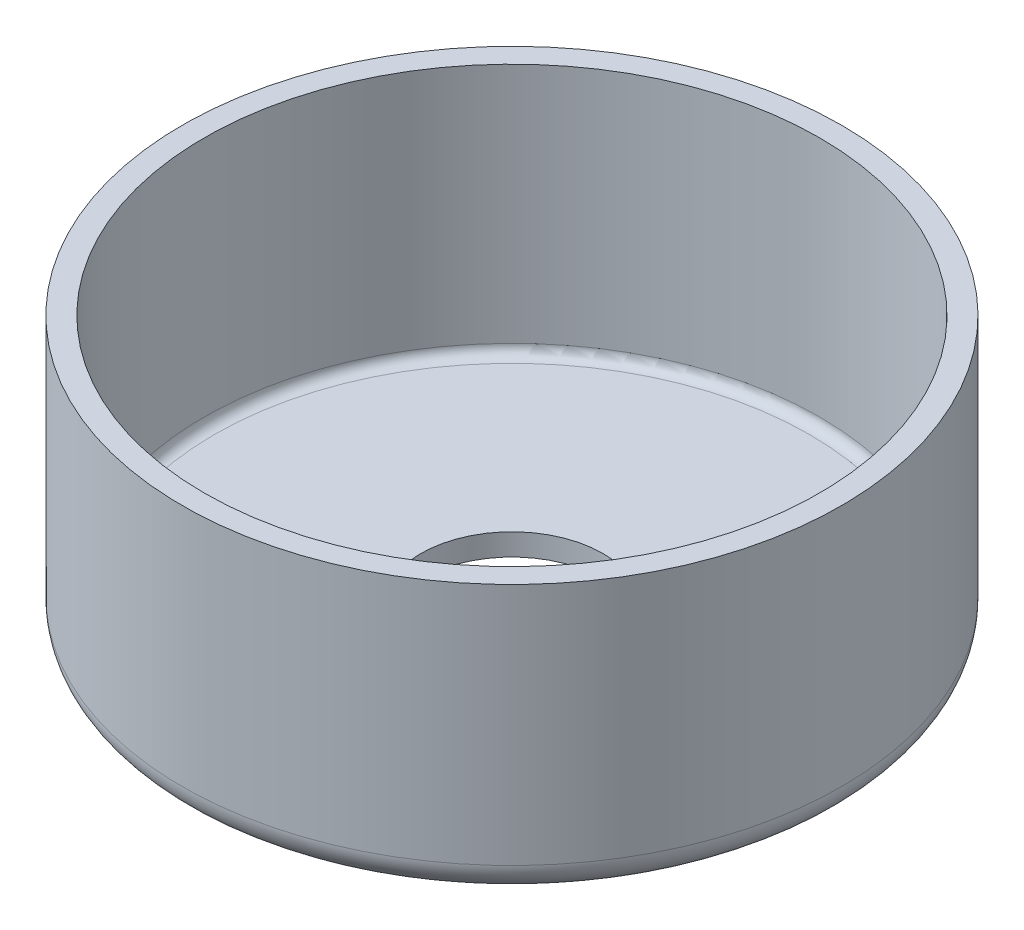
ISO-10303-21;
HEADER;
FILE_DESCRIPTION(('STEP AP214'),'2;1');
FILE_NAME('part.step','',(''),(''),'','','');
FILE_SCHEMA(('AUTOMOTIVE_DESIGN { 1 0 10303 214 1 1 1 1 }'));
ENDSEC;
DATA;
#1=APPLICATION_CONTEXT('core data for automotive mechanical design processes');
#2=APPLICATION_PROTOCOL_DEFINITION('international standard','automotive_design',2000,#1);
#3=PRODUCT_CONTEXT('',#1,'mechanical');
#4=PRODUCT('Part','Part','',(#3));
#5=PRODUCT_RELATED_PRODUCT_CATEGORY('part','',(#4));
#6=PRODUCT_DEFINITION_FORMATION('','',#4);
#7=PRODUCT_DEFINITION_CONTEXT('part definition',#1,'design');
#8=PRODUCT_DEFINITION('design','',#6,#7);
#9=PRODUCT_DEFINITION_SHAPE('','',#8);
#10=(LENGTH_UNIT() NAMED_UNIT(*) SI_UNIT(.MILLI.,.METRE.));
#11=(NAMED_UNIT(*) PLANE_ANGLE_UNIT() SI_UNIT($,.RADIAN.));
#12=(NAMED_UNIT(*) SI_UNIT($,.STERADIAN.) SOLID_ANGLE_UNIT());
#13=UNCERTAINTY_MEASURE_WITH_UNIT(LENGTH_MEASURE(1.E-05),#10,'distance_accuracy_value','');
#14=(GEOMETRIC_REPRESENTATION_CONTEXT(3) GLOBAL_UNCERTAINTY_ASSIGNED_CONTEXT((#13)) GLOBAL_UNIT_ASSIGNED_CONTEXT((#10,
#11,#12)) REPRESENTATION_CONTEXT('',''));
#15=CARTESIAN_POINT('',(0.,0.,0.));
#16=DIRECTION('',(0.,0.,1.));
#17=DIRECTION('',(1.,0.,0.));
#18=AXIS2_PLACEMENT_3D('',#15,#16,#17);
#19=CARTESIAN_POINT('',(0.,0.,0.));
#20=DIRECTION('',(0.,-1.,0.));
#21=DIRECTION('',(0.,0.,-1.));
#22=AXIS2_PLACEMENT_3D('',#19,#20,#21);
#23=CYLINDRICAL_SURFACE('',#22,303.4125);
#24=CARTESIAN_POINT('',(0.,21.5875,0.));
#25=DIRECTION('',(0.,-1.,0.));
#26=DIRECTION('',(0.,0.,-1.));
#27=AXIS2_PLACEMENT_3D('',#24,#25,#26);
#28=CIRCLE('',#27,303.4125);
#29=CARTESIAN_POINT('',(0.,21.5875,-303.4125));
#30=VERTEX_POINT('',#29);
#31=EDGE_CURVE('E12',#30,#30,#28,.T.);
#32=ORIENTED_EDGE('',*,*,#31,.T.);
#33=EDGE_LOOP('',(#32));
#34=FACE_BOUND('',#33,.T.);
#35=CARTESIAN_POINT('',(0.,260.,0.));
#36=DIRECTION('',(0.,-1.,0.));
#37=DIRECTION('',(0.,0.,-1.));
#38=AXIS2_PLACEMENT_3D('',#35,#36,#37);
#39=CIRCLE('',#38,303.4125);
#40=CARTESIAN_POINT('',(0.,260.,-303.4125));
#41=VERTEX_POINT('',#40);
#42=EDGE_CURVE('E73',#41,#41,#39,.T.);
#43=ORIENTED_EDGE('',*,*,#42,.F.);
#44=EDGE_LOOP('',(#43));
#45=FACE_BOUND('',#44,.T.);
#46=ADVANCED_FACE('F45',(#34,#45),#23,.F.);
#47=CARTESIAN_POINT('',(0.,21.5875,0.));
#48=DIRECTION('',(0.,-1.,0.));
#49=DIRECTION('',(0.,0.,-1.));
#50=AXIS2_PLACEMENT_3D('',#47,#48,#49);
#51=TOROIDAL_SURFACE('',#50,293.4125,9.99999999999999);
#52=CARTESIAN_POINT('',(0.,11.5875,0.));
#53=DIRECTION('',(0.,-1.,0.));
#54=DIRECTION('',(0.,0.,-1.));
#55=AXIS2_PLACEMENT_3D('',#52,#53,#54);
#56=CIRCLE('',#55,293.4125);
#57=CARTESIAN_POINT('',(0.,11.5875,-293.4125));
#58=VERTEX_POINT('',#57);
#59=EDGE_CURVE('E51',#58,#58,#56,.T.);
#60=ORIENTED_EDGE('',*,*,#59,.T.);
#61=EDGE_LOOP('',(#60));
#62=FACE_BOUND('',#61,.T.);
#63=ORIENTED_EDGE('',*,*,#31,.F.);
#64=EDGE_LOOP('',(#63));
#65=FACE_BOUND('',#64,.T.);
#66=ADVANCED_FACE('F163',(#62,#65),#51,.F.);
#67=CARTESIAN_POINT('',(0.,11.5875,0.));
#68=DIRECTION('',(0.,1.,0.));
#69=DIRECTION('',(0.,0.,1.));
#70=AXIS2_PLACEMENT_3D('',#67,#68,#69);
#71=PLANE('',#70);
#72=CARTESIAN_POINT('',(0.,11.5875,0.));
#73=DIRECTION('',(0.,-1.,0.));
#74=DIRECTION('',(0.,0.,-1.));
#75=AXIS2_PLACEMENT_3D('',#72,#73,#74);
#76=CIRCLE('',#75,90.);
#77=CARTESIAN_POINT('',(0.,11.5875,-90.));
#78=VERTEX_POINT('',#77);
#79=EDGE_CURVE('E55',#78,#78,#76,.T.);
#80=ORIENTED_EDGE('',*,*,#79,.T.);
#81=EDGE_LOOP('',(#80));
#82=FACE_BOUND('',#81,.T.);
#83=ORIENTED_EDGE('',*,*,#59,.F.);
#84=EDGE_LOOP('',(#83));
#85=FACE_BOUND('',#84,.T.);
#86=ADVANCED_FACE('F160',(#82,#85),#71,.T.);
#87=CARTESIAN_POINT('',(0.,0.,0.));
#88=DIRECTION('',(0.,-1.,0.));
#89=DIRECTION('',(0.,0.,-1.));
#90=AXIS2_PLACEMENT_3D('',#87,#88,#89);
#91=CYLINDRICAL_SURFACE('',#90,90.);
#92=CARTESIAN_POINT('',(0.,-10.,0.));
#93=DIRECTION('',(0.,-1.,0.));
#94=DIRECTION('',(0.,0.,-1.));
#95=AXIS2_PLACEMENT_3D('',#92,#93,#94);
#96=CIRCLE('',#95,90.);
#97=CARTESIAN_POINT('',(0.,-10.,-90.));
#98=VERTEX_POINT('',#97);
#99=EDGE_CURVE('E59',#98,#98,#96,.T.);
#100=ORIENTED_EDGE('',*,*,#99,.T.);
#101=EDGE_LOOP('',(#100));
#102=FACE_BOUND('',#101,.T.);
#103=ORIENTED_EDGE('',*,*,#79,.F.);
#104=EDGE_LOOP('',(#103));
#105=FACE_BOUND('',#104,.T.);
#106=ADVANCED_FACE('F156',(#102,#105),#91,.F.);
#107=CARTESIAN_POINT('',(0.,-10.,0.));
#108=DIRECTION('',(0.,-1.,0.));
#109=DIRECTION('',(0.,0.,-1.));
#110=AXIS2_PLACEMENT_3D('',#107,#108,#109);
#111=PLANE('',#110);
#112=CARTESIAN_POINT('',(0.,-10.,0.));
#113=DIRECTION('',(0.,-1.,0.));
#114=DIRECTION('',(0.,0.,-1.));
#115=AXIS2_PLACEMENT_3D('',#112,#113,#114);
#116=CIRCLE('',#115,295.);
#117=CARTESIAN_POINT('',(0.,-10.,-295.));
#118=VERTEX_POINT('',#117);
#119=EDGE_CURVE('E64',#118,#118,#116,.T.);
#120=ORIENTED_EDGE('',*,*,#119,.T.);
#121=EDGE_LOOP('',(#120));
#122=FACE_BOUND('',#121,.T.);
#123=ORIENTED_EDGE('',*,*,#99,.F.);
#124=EDGE_LOOP('',(#123));
#125=FACE_BOUND('',#124,.T.);
#126=ADVANCED_FACE('F152',(#122,#125),#111,.T.);
#127=CARTESIAN_POINT('',(0.,20.,0.));
#128=DIRECTION('',(0.,-1.,0.));
#129=DIRECTION('',(0.,0.,-1.));
#130=AXIS2_PLACEMENT_3D('',#127,#128,#129);
#131=TOROIDAL_SURFACE('',#130,295.,30.);
#132=ORIENTED_EDGE('',*,*,#119,.F.);
#133=EDGE_LOOP('',(#132));
#134=FACE_BOUND('',#133,.T.);
#135=CARTESIAN_POINT('',(0.,20.0000000000001,0.));
#136=DIRECTION('',(0.,-1.,0.));
#137=DIRECTION('',(0.,0.,-1.));
#138=AXIS2_PLACEMENT_3D('',#135,#136,#137);
#139=CIRCLE('',#138,325.);
#140=CARTESIAN_POINT('',(0.,20.0000000000001,-325.));
#141=VERTEX_POINT('',#140);
#142=EDGE_CURVE('E67',#141,#141,#139,.T.);
#143=ORIENTED_EDGE('',*,*,#142,.T.);
#144=EDGE_LOOP('',(#143));
#145=FACE_BOUND('',#144,.T.);
#146=ADVANCED_FACE('F148',(#134,#145),#131,.T.);
#147=CARTESIAN_POINT('',(0.,0.,0.));
#148=DIRECTION('',(0.,-1.,0.));
#149=DIRECTION('',(0.,0.,-1.));
#150=AXIS2_PLACEMENT_3D('',#147,#148,#149);
#151=CYLINDRICAL_SURFACE('',#150,325.);
#152=CARTESIAN_POINT('',(0.,260.,0.));
#153=DIRECTION('',(0.,-1.,0.));
#154=DIRECTION('',(0.,0.,-1.));
#155=AXIS2_PLACEMENT_3D('',#152,#153,#154);
#156=CIRCLE('',#155,325.);
#157=CARTESIAN_POINT('',(0.,260.,-325.));
#158=VERTEX_POINT('',#157);
#159=EDGE_CURVE('E70',#158,#158,#156,.T.);
#160=ORIENTED_EDGE('',*,*,#159,.T.);
#161=EDGE_LOOP('',(#160));
#162=FACE_BOUND('',#161,.T.);
#163=ORIENTED_EDGE('',*,*,#142,.F.);
#164=EDGE_LOOP('',(#163));
#165=FACE_BOUND('',#164,.T.);
#166=ADVANCED_FACE('F144',(#162,#165),#151,.T.);
#167=CARTESIAN_POINT('',(0.,260.,0.));
#168=DIRECTION('',(0.,1.,0.));
#169=DIRECTION('',(0.,0.,1.));
#170=AXIS2_PLACEMENT_3D('',#167,#168,#169);
#171=PLANE('',#170);
#172=ORIENTED_EDGE('',*,*,#42,.T.);
#173=EDGE_LOOP('',(#172));
#174=FACE_BOUND('',#173,.T.);
#175=ORIENTED_EDGE('',*,*,#159,.F.);
#176=EDGE_LOOP('',(#175));
#177=FACE_BOUND('',#176,.T.);
#178=ADVANCED_FACE('F142',(#174,#177),#171,.T.);
#179=CLOSED_SHELL('',(#46,#66,#86,#106,#126,#146,#166,#178));
#180=CARTESIAN_POINT('',(0.,0.,0.));
#181=DIRECTION('',(0.,-1.,0.));
#182=DIRECTION('',(0.,0.,-1.));
#183=AXIS2_PLACEMENT_3D('',#180,#181,#182);
#184=CYLINDRICAL_SURFACE('',#183,313.4125);
#185=CARTESIAN_POINT('',(0.,21.5875,0.));
#186=DIRECTION('',(0.,-1.,0.));
#187=DIRECTION('',(0.,0.,-1.));
#188=AXIS2_PLACEMENT_3D('',#185,#186,#187);
#189=CIRCLE('',#188,313.4125);
#190=CARTESIAN_POINT('',(0.,21.5875,-313.4125));
#191=VERTEX_POINT('',#190);
#192=EDGE_CURVE('E76',#191,#191,#189,.T.);
#193=ORIENTED_EDGE('',*,*,#192,.F.);
#194=EDGE_LOOP('',(#193));
#195=FACE_BOUND('',#194,.T.);
#196=CARTESIAN_POINT('',(0.,250.,0.));
#197=DIRECTION('',(0.,-1.,0.));
#198=DIRECTION('',(0.,0.,-1.));
#199=AXIS2_PLACEMENT_3D('',#196,#197,#198);
#200=CIRCLE('',#199,313.4125);
#201=CARTESIAN_POINT('',(0.,250.,-313.4125));
#202=VERTEX_POINT('',#201);
#203=EDGE_CURVE('E97',#202,#202,#200,.T.);
#204=ORIENTED_EDGE('',*,*,#203,.T.);
#205=EDGE_LOOP('',(#204));
#206=FACE_BOUND('',#205,.T.);
#207=ADVANCED_FACE('F101',(#195,#206),#184,.T.);
#208=CARTESIAN_POINT('',(0.,21.5875,0.));
#209=DIRECTION('',(0.,-1.,0.));
#210=DIRECTION('',(0.,0.,-1.));
#211=AXIS2_PLACEMENT_3D('',#208,#209,#210);
#212=TOROIDAL_SURFACE('',#211,293.4125,20.);
#213=CARTESIAN_POINT('',(0.,1.5875,0.));
#214=DIRECTION('',(0.,-1.,0.));
#215=DIRECTION('',(0.,0.,-1.));
#216=AXIS2_PLACEMENT_3D('',#213,#214,#215);
#217=CIRCLE('',#216,293.4125);
#218=CARTESIAN_POINT('',(0.,1.5875,-293.4125));
#219=VERTEX_POINT('',#218);
#220=EDGE_CURVE('E79',#219,#219,#217,.T.);
#221=ORIENTED_EDGE('',*,*,#220,.F.);
#222=EDGE_LOOP('',(#221));
#223=FACE_BOUND('',#222,.T.);
#224=ORIENTED_EDGE('',*,*,#192,.T.);
#225=EDGE_LOOP('',(#224));
#226=FACE_BOUND('',#225,.T.);
#227=ADVANCED_FACE('F129',(#223,#226),#212,.T.);
#228=CARTESIAN_POINT('',(0.,1.58749999999999,0.));
#229=DIRECTION('',(0.,1.,0.));
#230=DIRECTION('',(0.,0.,1.));
#231=AXIS2_PLACEMENT_3D('',#228,#229,#230);
#232=PLANE('',#231);
#233=CARTESIAN_POINT('',(0.,1.58749999999998,0.));
#234=DIRECTION('',(0.,-1.,0.));
#235=DIRECTION('',(0.,0.,-1.));
#236=AXIS2_PLACEMENT_3D('',#233,#234,#235);
#237=CIRCLE('',#236,100.);
#238=CARTESIAN_POINT('',(0.,1.58749999999998,-100.));
#239=VERTEX_POINT('',#238);
#240=EDGE_CURVE('E82',#239,#239,#237,.T.);
#241=ORIENTED_EDGE('',*,*,#240,.F.);
#242=EDGE_LOOP('',(#241));
#243=FACE_BOUND('',#242,.T.);
#244=ORIENTED_EDGE('',*,*,#220,.T.);
#245=EDGE_LOOP('',(#244));
#246=FACE_BOUND('',#245,.T.);
#247=ADVANCED_FACE('F136',(#243,#246),#232,.F.);
#248=CARTESIAN_POINT('',(0.,0.,0.));
#249=DIRECTION('',(0.,-1.,0.));
#250=DIRECTION('',(0.,0.,-1.));
#251=AXIS2_PLACEMENT_3D('',#248,#249,#250);
#252=CYLINDRICAL_SURFACE('',#251,100.);
#253=CARTESIAN_POINT('',(0.,0.,0.));
#254=DIRECTION('',(0.,-1.,0.));
#255=DIRECTION('',(0.,0.,-1.));
#256=AXIS2_PLACEMENT_3D('',#253,#254,#255);
#257=CIRCLE('',#256,100.);
#258=CARTESIAN_POINT('',(0.,0.,-100.));
#259=VERTEX_POINT('',#258);
#260=EDGE_CURVE('E85',#259,#259,#257,.T.);
#261=ORIENTED_EDGE('',*,*,#260,.F.);
#262=EDGE_LOOP('',(#261));
#263=FACE_BOUND('',#262,.T.);
#264=ORIENTED_EDGE('',*,*,#240,.T.);
#265=EDGE_LOOP('',(#264));
#266=FACE_BOUND('',#265,.T.);
#267=ADVANCED_FACE('F124',(#263,#266),#252,.T.);
#268=CARTESIAN_POINT('',(0.,0.,0.));
#269=DIRECTION('',(0.,-1.,0.));
#270=DIRECTION('',(0.,0.,-1.));
#271=AXIS2_PLACEMENT_3D('',#268,#269,#270);
#272=PLANE('',#271);
#273=CARTESIAN_POINT('',(0.,0.,0.));
#274=DIRECTION('',(0.,-1.,0.));
#275=DIRECTION('',(0.,0.,-1.));
#276=AXIS2_PLACEMENT_3D('',#273,#274,#275);
#277=CIRCLE('',#276,295.);
#278=CARTESIAN_POINT('',(0.,0.,-295.));
#279=VERTEX_POINT('',#278);
#280=EDGE_CURVE('E88',#279,#279,#277,.T.);
#281=ORIENTED_EDGE('',*,*,#280,.F.);
#282=EDGE_LOOP('',(#281));
#283=FACE_BOUND('',#282,.T.);
#284=ORIENTED_EDGE('',*,*,#260,.T.);
#285=EDGE_LOOP('',(#284));
#286=FACE_BOUND('',#285,.T.);
#287=ADVANCED_FACE('F118',(#283,#286),#272,.F.);
#288=CARTESIAN_POINT('',(0.,20.,0.));
#289=DIRECTION('',(0.,-1.,0.));
#290=DIRECTION('',(0.,0.,-1.));
#291=AXIS2_PLACEMENT_3D('',#288,#289,#290);
#292=TOROIDAL_SURFACE('',#291,295.,20.);
#293=ORIENTED_EDGE('',*,*,#280,.T.);
#294=EDGE_LOOP('',(#293));
#295=FACE_BOUND('',#294,.T.);
#296=CARTESIAN_POINT('',(0.,20.0000000000001,0.));
#297=DIRECTION('',(0.,-1.,0.));
#298=DIRECTION('',(0.,0.,-1.));
#299=AXIS2_PLACEMENT_3D('',#296,#297,#298);
#300=CIRCLE('',#299,315.);
#301=CARTESIAN_POINT('',(0.,20.0000000000001,-315.));
#302=VERTEX_POINT('',#301);
#303=EDGE_CURVE('E91',#302,#302,#300,.T.);
#304=ORIENTED_EDGE('',*,*,#303,.F.);
#305=EDGE_LOOP('',(#304));
#306=FACE_BOUND('',#305,.T.);
#307=ADVANCED_FACE('F113',(#295,#306),#292,.F.);
#308=CARTESIAN_POINT('',(0.,0.,0.));
#309=DIRECTION('',(0.,-1.,0.));
#310=DIRECTION('',(0.,0.,-1.));
#311=AXIS2_PLACEMENT_3D('',#308,#309,#310);
#312=CYLINDRICAL_SURFACE('',#311,315.);
#313=CARTESIAN_POINT('',(0.,250.,0.));
#314=DIRECTION('',(0.,-1.,0.));
#315=DIRECTION('',(0.,0.,-1.));
#316=AXIS2_PLACEMENT_3D('',#313,#314,#315);
#317=CIRCLE('',#316,315.);
#318=CARTESIAN_POINT('',(0.,250.,-315.));
#319=VERTEX_POINT('',#318);
#320=EDGE_CURVE('E94',#319,#319,#317,.T.);
#321=ORIENTED_EDGE('',*,*,#320,.F.);
#322=EDGE_LOOP('',(#321));
#323=FACE_BOUND('',#322,.T.);
#324=ORIENTED_EDGE('',*,*,#303,.T.);
#325=EDGE_LOOP('',(#324));
#326=FACE_BOUND('',#325,.T.);
#327=ADVANCED_FACE('F106',(#323,#326),#312,.F.);
#328=CARTESIAN_POINT('',(0.,250.,0.));
#329=DIRECTION('',(0.,1.,0.));
#330=DIRECTION('',(0.,0.,1.));
#331=AXIS2_PLACEMENT_3D('',#328,#329,#330);
#332=PLANE('',#331);
#333=ORIENTED_EDGE('',*,*,#203,.F.);
#334=EDGE_LOOP('',(#333));
#335=FACE_BOUND('',#334,.T.);
#336=ORIENTED_EDGE('',*,*,#320,.T.);
#337=EDGE_LOOP('',(#336));
#338=FACE_BOUND('',#337,.T.);
#339=ADVANCED_FACE('F103',(#335,#338),#332,.F.);
#340=CLOSED_SHELL('',(#207,#227,#247,#267,#287,#307,#327,#339));
#341=ORIENTED_CLOSED_SHELL('',*,#340,.T.);
#342=BREP_WITH_VOIDS('B2',#179,(#341));
#343=ADVANCED_BREP_SHAPE_REPRESENTATION('',(#18,#342),#14);
#344=SHAPE_DEFINITION_REPRESENTATION(#9,#343);
ENDSEC;
END-ISO-10303-21;
